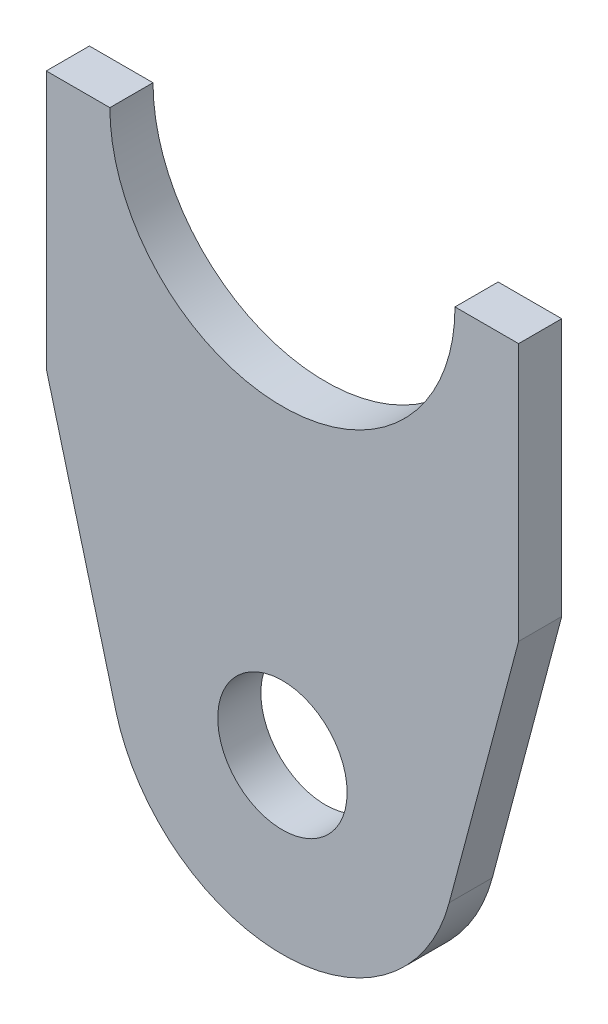
ISO-10303-21;
HEADER;
FILE_DESCRIPTION(('STEP AP214'),'2;1');
FILE_NAME('part.step','',(''),(''),'','','');
FILE_SCHEMA(('AUTOMOTIVE_DESIGN { 1 0 10303 214 1 1 1 1 }'));
ENDSEC;
DATA;
#1=APPLICATION_CONTEXT('core data for automotive mechanical design processes');
#2=APPLICATION_PROTOCOL_DEFINITION('international standard','automotive_design',2000,#1);
#3=PRODUCT_CONTEXT('',#1,'mechanical');
#4=PRODUCT('Part','Part','',(#3));
#5=PRODUCT_RELATED_PRODUCT_CATEGORY('part','',(#4));
#6=PRODUCT_DEFINITION_FORMATION('','',#4);
#7=PRODUCT_DEFINITION_CONTEXT('part definition',#1,'design');
#8=PRODUCT_DEFINITION('design','',#6,#7);
#9=PRODUCT_DEFINITION_SHAPE('','',#8);
#10=(LENGTH_UNIT() NAMED_UNIT(*) SI_UNIT(.MILLI.,.METRE.));
#11=(NAMED_UNIT(*) PLANE_ANGLE_UNIT() SI_UNIT($,.RADIAN.));
#12=(NAMED_UNIT(*) SI_UNIT($,.STERADIAN.) SOLID_ANGLE_UNIT());
#13=UNCERTAINTY_MEASURE_WITH_UNIT(LENGTH_MEASURE(1.E-05),#10,'distance_accuracy_value','');
#14=(GEOMETRIC_REPRESENTATION_CONTEXT(3) GLOBAL_UNCERTAINTY_ASSIGNED_CONTEXT((#13)) GLOBAL_UNIT_ASSIGNED_CONTEXT((#10,
#11,#12)) REPRESENTATION_CONTEXT('',''));
#15=CARTESIAN_POINT('',(0.,0.,0.));
#16=DIRECTION('',(0.,0.,1.));
#17=DIRECTION('',(1.,0.,0.));
#18=AXIS2_PLACEMENT_3D('',#15,#16,#17);
#19=CARTESIAN_POINT('',(-2.94204705077183E-05,34.9249921781263,3.175));
#20=DIRECTION('',(0.,0.,-1.));
#21=DIRECTION('',(-1.,0.,0.));
#22=AXIS2_PLACEMENT_3D('',#19,#20,#21);
#23=CYLINDRICAL_SURFACE('',#22,12.7);
#24=CARTESIAN_POINT('',(-2.94204705077183E-05,34.9249921781263,0.));
#25=DIRECTION('',(0.,0.,1.));
#26=DIRECTION('',(1.,0.,0.));
#27=AXIS2_PLACEMENT_3D('',#24,#25,#26);
#28=CIRCLE('',#27,12.7);
#29=CARTESIAN_POINT('',(-12.7000294204705,34.9249921781263,0.));
#30=VERTEX_POINT('',#29);
#31=CARTESIAN_POINT('',(12.6999705795295,34.9249921781263,0.));
#32=VERTEX_POINT('',#31);
#33=EDGE_CURVE('E133',#30,#32,#28,.T.);
#34=ORIENTED_EDGE('',*,*,#33,.F.);
#35=DIRECTION('',(0.,0.,-1.));
#36=VECTOR('',#35,1.);
#37=CARTESIAN_POINT('',(-12.7000294204705,34.9249921781263,3.175));
#38=LINE('',#37,#36);
#39=CARTESIAN_POINT('',(-12.7000294204705,34.9249921781263,3.175));
#40=VERTEX_POINT('',#39);
#41=EDGE_CURVE('E11',#40,#30,#38,.T.);
#42=ORIENTED_EDGE('',*,*,#41,.F.);
#43=CARTESIAN_POINT('',(-2.94204705077183E-05,34.9249921781263,3.175));
#44=DIRECTION('',(0.,0.,1.));
#45=DIRECTION('',(1.,0.,0.));
#46=AXIS2_PLACEMENT_3D('',#43,#44,#45);
#47=CIRCLE('',#46,12.7);
#48=CARTESIAN_POINT('',(12.6999705795295,34.9249921781263,3.175));
#49=VERTEX_POINT('',#48);
#50=EDGE_CURVE('E152',#40,#49,#47,.T.);
#51=ORIENTED_EDGE('',*,*,#50,.T.);
#52=DIRECTION('',(0.,0.,-1.));
#53=VECTOR('',#52,1.);
#54=CARTESIAN_POINT('',(12.6999705795295,34.9249921781263,3.175));
#55=LINE('',#54,#53);
#56=EDGE_CURVE('E52',#49,#32,#55,.T.);
#57=ORIENTED_EDGE('',*,*,#56,.T.);
#58=EDGE_LOOP('',(#34,#42,#51,#57));
#59=FACE_BOUND('',#58,.T.);
#60=ADVANCED_FACE('F36',(#59),#23,.F.);
#61=CARTESIAN_POINT('',(0.,34.9249921781263,3.175));
#62=DIRECTION('',(0.,1.,0.));
#63=DIRECTION('',(-1.,0.,0.));
#64=AXIS2_PLACEMENT_3D('',#61,#62,#63);
#65=PLANE('',#64);
#66=DIRECTION('',(1.,0.,0.));
#67=VECTOR('',#66,1.);
#68=CARTESIAN_POINT('',(0.,34.9249921781263,0.));
#69=LINE('',#68,#67);
#70=CARTESIAN_POINT('',(-17.3811398022022,34.9249921781263,0.));
#71=VERTEX_POINT('',#70);
#72=EDGE_CURVE('E135',#71,#30,#69,.T.);
#73=ORIENTED_EDGE('',*,*,#72,.F.);
#74=DIRECTION('',(0.,0.,-1.));
#75=VECTOR('',#74,1.);
#76=CARTESIAN_POINT('',(-17.3811398022022,34.9249921781263,3.175));
#77=LINE('',#76,#75);
#78=CARTESIAN_POINT('',(-17.3811398022022,34.9249921781263,3.175));
#79=VERTEX_POINT('',#78);
#80=EDGE_CURVE('E44',#79,#71,#77,.T.);
#81=ORIENTED_EDGE('',*,*,#80,.F.);
#82=DIRECTION('',(1.,0.,0.));
#83=VECTOR('',#82,1.);
#84=CARTESIAN_POINT('',(0.,34.9249921781263,3.175));
#85=LINE('',#84,#83);
#86=EDGE_CURVE('E128',#79,#40,#85,.T.);
#87=ORIENTED_EDGE('',*,*,#86,.T.);
#88=ORIENTED_EDGE('',*,*,#41,.T.);
#89=EDGE_LOOP('',(#73,#81,#87,#88));
#90=FACE_BOUND('',#89,.T.);
#91=ADVANCED_FACE('F176',(#90),#65,.T.);
#92=CARTESIAN_POINT('',(-17.3811398022022,0.,3.175));
#93=DIRECTION('',(1.,0.,0.));
#94=DIRECTION('',(0.,0.,-1.));
#95=AXIS2_PLACEMENT_3D('',#92,#93,#94);
#96=PLANE('',#95);
#97=DIRECTION('',(0.,-1.,0.));
#98=VECTOR('',#97,1.);
#99=CARTESIAN_POINT('',(-17.3811398022022,0.,0.));
#100=LINE('',#99,#98);
#101=CARTESIAN_POINT('',(-17.3811398022022,15.9482351463773,0.));
#102=VERTEX_POINT('',#101);
#103=EDGE_CURVE('E138',#71,#102,#100,.T.);
#104=ORIENTED_EDGE('',*,*,#103,.T.);
#105=DIRECTION('',(0.,0.,-1.));
#106=VECTOR('',#105,1.);
#107=CARTESIAN_POINT('',(-17.3811398022022,15.9482351463773,3.175));
#108=LINE('',#107,#106);
#109=CARTESIAN_POINT('',(-17.3811398022022,15.9482351463773,3.175));
#110=VERTEX_POINT('',#109);
#111=EDGE_CURVE('E159',#110,#102,#108,.T.);
#112=ORIENTED_EDGE('',*,*,#111,.F.);
#113=DIRECTION('',(0.,-1.,0.));
#114=VECTOR('',#113,1.);
#115=CARTESIAN_POINT('',(-17.3811398022022,0.,3.175));
#116=LINE('',#115,#114);
#117=EDGE_CURVE('E166',#79,#110,#116,.T.);
#118=ORIENTED_EDGE('',*,*,#117,.F.);
#119=ORIENTED_EDGE('',*,*,#80,.T.);
#120=EDGE_LOOP('',(#104,#112,#118,#119));
#121=FACE_BOUND('',#120,.T.);
#122=ADVANCED_FACE('F164',(#121),#96,.F.);
#123=CARTESIAN_POINT('',(-12.2736488619794,-3.26305740262585,3.175));
#124=DIRECTION('',(0.966429044250348,0.256933653750067,0.));
#125=DIRECTION('',(-0.256933653750067,0.966429044250348,0.));
#126=AXIS2_PLACEMENT_3D('',#123,#124,#125);
#127=PLANE('',#126);
#128=DIRECTION('',(0.256933653750067,-0.966429044250348,0.));
#129=VECTOR('',#128,1.);
#130=CARTESIAN_POINT('',(-12.2736488619794,-3.26305740262585,0.));
#131=LINE('',#130,#129);
#132=CARTESIAN_POINT('',(-12.2736488619794,-3.26305740262585,0.));
#133=VERTEX_POINT('',#132);
#134=EDGE_CURVE('E141',#102,#133,#131,.T.);
#135=ORIENTED_EDGE('',*,*,#134,.T.);
#136=DIRECTION('',(0.,0.,-1.));
#137=VECTOR('',#136,1.);
#138=CARTESIAN_POINT('',(-12.2736488619794,-3.26305740262585,3.175));
#139=LINE('',#138,#137);
#140=CARTESIAN_POINT('',(-12.2736488619794,-3.26305740262585,3.175));
#141=VERTEX_POINT('',#140);
#142=EDGE_CURVE('E156',#141,#133,#139,.T.);
#143=ORIENTED_EDGE('',*,*,#142,.F.);
#144=DIRECTION('',(0.256933653750067,-0.966429044250348,0.));
#145=VECTOR('',#144,1.);
#146=CARTESIAN_POINT('',(-12.2736488619794,-3.26305740262585,3.175));
#147=LINE('',#146,#145);
#148=EDGE_CURVE('E278',#110,#141,#147,.T.);
#149=ORIENTED_EDGE('',*,*,#148,.F.);
#150=ORIENTED_EDGE('',*,*,#111,.T.);
#151=EDGE_LOOP('',(#135,#143,#149,#150));
#152=FACE_BOUND('',#151,.T.);
#153=ADVANCED_FACE('F203',(#152),#127,.F.);
#154=CARTESIAN_POINT('',(0.,0.,3.175));
#155=DIRECTION('',(0.,0.,-1.));
#156=DIRECTION('',(-1.,0.,0.));
#157=AXIS2_PLACEMENT_3D('',#154,#155,#156);
#158=CYLINDRICAL_SURFACE('',#157,12.7);
#159=CARTESIAN_POINT('',(0.,0.,0.));
#160=DIRECTION('',(0.,0.,1.));
#161=DIRECTION('',(1.,0.,0.));
#162=AXIS2_PLACEMENT_3D('',#159,#160,#161);
#163=CIRCLE('',#162,12.7);
#164=CARTESIAN_POINT('',(12.2736581963723,-3.26302229208193,0.));
#165=VERTEX_POINT('',#164);
#166=EDGE_CURVE('E143',#133,#165,#163,.T.);
#167=ORIENTED_EDGE('',*,*,#166,.T.);
#168=DIRECTION('',(0.,0.,-1.));
#169=VECTOR('',#168,1.);
#170=CARTESIAN_POINT('',(12.2736581963723,-3.26302229208193,3.175));
#171=LINE('',#170,#169);
#172=CARTESIAN_POINT('',(12.2736581963723,-3.26302229208193,3.175));
#173=VERTEX_POINT('',#172);
#174=EDGE_CURVE('E111',#173,#165,#171,.T.);
#175=ORIENTED_EDGE('',*,*,#174,.F.);
#176=CARTESIAN_POINT('',(0.,0.,3.175));
#177=DIRECTION('',(0.,0.,1.));
#178=DIRECTION('',(1.,0.,0.));
#179=AXIS2_PLACEMENT_3D('',#176,#177,#178);
#180=CIRCLE('',#179,12.7);
#181=EDGE_CURVE('E120',#141,#173,#180,.T.);
#182=ORIENTED_EDGE('',*,*,#181,.F.);
#183=ORIENTED_EDGE('',*,*,#142,.T.);
#184=EDGE_LOOP('',(#167,#175,#182,#183));
#185=FACE_BOUND('',#184,.T.);
#186=ADVANCED_FACE('F209',(#185),#158,.T.);
#187=CARTESIAN_POINT('',(12.2736581963723,-3.26302229208193,3.175));
#188=DIRECTION('',(0.966429779241912,-0.256930889140309,0.));
#189=DIRECTION('',(0.256930889140309,0.966429779241912,0.));
#190=AXIS2_PLACEMENT_3D('',#187,#188,#189);
#191=PLANE('',#190);
#192=DIRECTION('',(-0.256930889140309,-0.966429779241912,0.));
#193=VECTOR('',#192,1.);
#194=CARTESIAN_POINT('',(12.2736581963723,-3.26302229208193,0.));
#195=LINE('',#194,#193);
#196=CARTESIAN_POINT('',(17.3810809612612,15.9482351463773,0.));
#197=VERTEX_POINT('',#196);
#198=EDGE_CURVE('E107',#197,#165,#195,.T.);
#199=ORIENTED_EDGE('',*,*,#198,.F.);
#200=DIRECTION('',(0.,0.,-1.));
#201=VECTOR('',#200,1.);
#202=CARTESIAN_POINT('',(17.3810809612612,15.9482351463773,3.175));
#203=LINE('',#202,#201);
#204=CARTESIAN_POINT('',(17.3810809612612,15.9482351463773,3.175));
#205=VERTEX_POINT('',#204);
#206=EDGE_CURVE('E102',#205,#197,#203,.T.);
#207=ORIENTED_EDGE('',*,*,#206,.F.);
#208=DIRECTION('',(-0.256930889140309,-0.966429779241912,0.));
#209=VECTOR('',#208,1.);
#210=CARTESIAN_POINT('',(12.2736581963723,-3.26302229208193,3.175));
#211=LINE('',#210,#209);
#212=EDGE_CURVE('E105',#205,#173,#211,.T.);
#213=ORIENTED_EDGE('',*,*,#212,.T.);
#214=ORIENTED_EDGE('',*,*,#174,.T.);
#215=EDGE_LOOP('',(#199,#207,#213,#214));
#216=FACE_BOUND('',#215,.T.);
#217=ADVANCED_FACE('F104',(#216),#191,.T.);
#218=CARTESIAN_POINT('',(17.3810809612612,0.,3.175));
#219=DIRECTION('',(1.,0.,0.));
#220=DIRECTION('',(0.,1.,0.));
#221=AXIS2_PLACEMENT_3D('',#218,#219,#220);
#222=PLANE('',#221);
#223=DIRECTION('',(0.,-1.,0.));
#224=VECTOR('',#223,1.);
#225=CARTESIAN_POINT('',(17.3810809612612,0.,0.));
#226=LINE('',#225,#224);
#227=CARTESIAN_POINT('',(17.3810809612612,34.9249921781263,0.));
#228=VERTEX_POINT('',#227);
#229=EDGE_CURVE('E147',#228,#197,#226,.T.);
#230=ORIENTED_EDGE('',*,*,#229,.F.);
#231=DIRECTION('',(0.,0.,-1.));
#232=VECTOR('',#231,1.);
#233=CARTESIAN_POINT('',(17.3810809612612,34.9249921781263,3.175));
#234=LINE('',#233,#232);
#235=CARTESIAN_POINT('',(17.3810809612612,34.9249921781263,3.175));
#236=VERTEX_POINT('',#235);
#237=EDGE_CURVE('E77',#236,#228,#234,.T.);
#238=ORIENTED_EDGE('',*,*,#237,.F.);
#239=DIRECTION('',(0.,-1.,0.));
#240=VECTOR('',#239,1.);
#241=CARTESIAN_POINT('',(17.3810809612612,0.,3.175));
#242=LINE('',#241,#240);
#243=EDGE_CURVE('E118',#236,#205,#242,.T.);
#244=ORIENTED_EDGE('',*,*,#243,.T.);
#245=ORIENTED_EDGE('',*,*,#206,.T.);
#246=EDGE_LOOP('',(#230,#238,#244,#245));
#247=FACE_BOUND('',#246,.T.);
#248=ADVANCED_FACE('F123',(#247),#222,.T.);
#249=EDGE_CURVE('E139',#32,#228,#69,.T.);
#250=ORIENTED_EDGE('',*,*,#249,.F.);
#251=ORIENTED_EDGE('',*,*,#56,.F.);
#252=EDGE_CURVE('E124',#49,#236,#85,.T.);
#253=ORIENTED_EDGE('',*,*,#252,.T.);
#254=ORIENTED_EDGE('',*,*,#237,.T.);
#255=EDGE_LOOP('',(#250,#251,#253,#254));
#256=FACE_BOUND('',#255,.T.);
#257=ADVANCED_FACE('F178',(#256),#65,.T.);
#258=CARTESIAN_POINT('',(0.,0.,3.175));
#259=DIRECTION('',(0.,0.,-1.));
#260=DIRECTION('',(-1.,0.,0.));
#261=AXIS2_PLACEMENT_3D('',#258,#259,#260);
#262=CYLINDRICAL_SURFACE('',#261,4.7625);
#263=CARTESIAN_POINT('',(0.,0.,3.175));
#264=DIRECTION('',(0.,0.,1.));
#265=DIRECTION('',(1.,0.,0.));
#266=AXIS2_PLACEMENT_3D('',#263,#264,#265);
#267=CIRCLE('',#266,4.7625);
#268=CARTESIAN_POINT('',(4.7625,0.,3.175));
#269=VERTEX_POINT('',#268);
#270=EDGE_CURVE('E126',#269,#269,#267,.T.);
#271=ORIENTED_EDGE('',*,*,#270,.T.);
#272=EDGE_LOOP('',(#271));
#273=FACE_BOUND('',#272,.T.);
#274=CARTESIAN_POINT('',(0.,0.,0.));
#275=DIRECTION('',(0.,0.,1.));
#276=DIRECTION('',(1.,0.,0.));
#277=AXIS2_PLACEMENT_3D('',#274,#275,#276);
#278=CIRCLE('',#277,4.7625);
#279=CARTESIAN_POINT('',(4.7625,0.,0.));
#280=VERTEX_POINT('',#279);
#281=EDGE_CURVE('E149',#280,#280,#278,.T.);
#282=ORIENTED_EDGE('',*,*,#281,.F.);
#283=EDGE_LOOP('',(#282));
#284=FACE_BOUND('',#283,.T.);
#285=ADVANCED_FACE('F180',(#273,#284),#262,.F.);
#286=CARTESIAN_POINT('',(0.,0.,3.175));
#287=DIRECTION('',(0.,0.,1.));
#288=DIRECTION('',(1.,0.,0.));
#289=AXIS2_PLACEMENT_3D('',#286,#287,#288);
#290=PLANE('',#289);
#291=ORIENTED_EDGE('',*,*,#50,.F.);
#292=ORIENTED_EDGE('',*,*,#86,.F.);
#293=ORIENTED_EDGE('',*,*,#117,.T.);
#294=ORIENTED_EDGE('',*,*,#148,.T.);
#295=ORIENTED_EDGE('',*,*,#181,.T.);
#296=ORIENTED_EDGE('',*,*,#212,.F.);
#297=ORIENTED_EDGE('',*,*,#243,.F.);
#298=ORIENTED_EDGE('',*,*,#252,.F.);
#299=EDGE_LOOP('',(#291,#292,#293,#294,#295,#296,#297,#298));
#300=FACE_BOUND('',#299,.T.);
#301=ORIENTED_EDGE('',*,*,#270,.F.);
#302=EDGE_LOOP('',(#301));
#303=FACE_BOUND('',#302,.T.);
#304=ADVANCED_FACE('F115',(#300,#303),#290,.T.);
#305=CARTESIAN_POINT('',(0.,0.,0.));
#306=DIRECTION('',(0.,0.,1.));
#307=DIRECTION('',(1.,0.,0.));
#308=AXIS2_PLACEMENT_3D('',#305,#306,#307);
#309=PLANE('',#308);
#310=ORIENTED_EDGE('',*,*,#33,.T.);
#311=ORIENTED_EDGE('',*,*,#249,.T.);
#312=ORIENTED_EDGE('',*,*,#229,.T.);
#313=ORIENTED_EDGE('',*,*,#198,.T.);
#314=ORIENTED_EDGE('',*,*,#166,.F.);
#315=ORIENTED_EDGE('',*,*,#134,.F.);
#316=ORIENTED_EDGE('',*,*,#103,.F.);
#317=ORIENTED_EDGE('',*,*,#72,.T.);
#318=EDGE_LOOP('',(#310,#311,#312,#313,#314,#315,#316,#317));
#319=FACE_BOUND('',#318,.T.);
#320=ORIENTED_EDGE('',*,*,#281,.T.);
#321=EDGE_LOOP('',(#320));
#322=FACE_BOUND('',#321,.T.);
#323=ADVANCED_FACE('F173',(#319,#322),#309,.F.);
#324=CLOSED_SHELL('',(#60,#91,#122,#153,#186,#217,#248,#257,#285,#304,#323));
#325=MANIFOLD_SOLID_BREP('B2',#324);
#326=ADVANCED_BREP_SHAPE_REPRESENTATION('',(#18,#325),#14);
#327=SHAPE_DEFINITION_REPRESENTATION(#9,#326);
ENDSEC;
END-ISO-10303-21;
